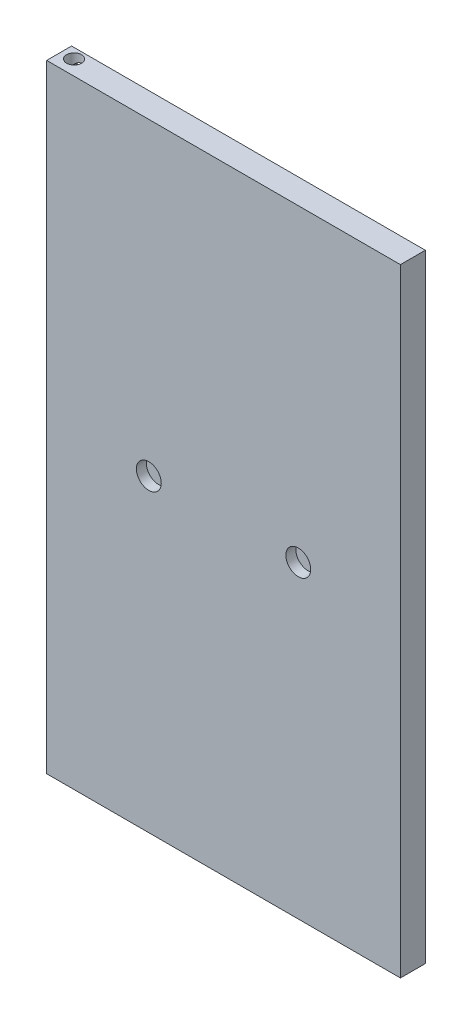
ISO-10303-21;
HEADER;
FILE_DESCRIPTION(('STEP AP214'),'2;1');
FILE_NAME('part.step','',(''),(''),'','','');
FILE_SCHEMA(('AUTOMOTIVE_DESIGN { 1 0 10303 214 1 1 1 1 }'));
ENDSEC;
DATA;
#1=APPLICATION_CONTEXT('core data for automotive mechanical design processes');
#2=APPLICATION_PROTOCOL_DEFINITION('international standard','automotive_design',2000,#1);
#3=PRODUCT_CONTEXT('',#1,'mechanical');
#4=PRODUCT('Part','Part','',(#3));
#5=PRODUCT_RELATED_PRODUCT_CATEGORY('part','',(#4));
#6=PRODUCT_DEFINITION_FORMATION('','',#4);
#7=PRODUCT_DEFINITION_CONTEXT('part definition',#1,'design');
#8=PRODUCT_DEFINITION('design','',#6,#7);
#9=PRODUCT_DEFINITION_SHAPE('','',#8);
#10=(LENGTH_UNIT() NAMED_UNIT(*) SI_UNIT(.MILLI.,.METRE.));
#11=(NAMED_UNIT(*) PLANE_ANGLE_UNIT() SI_UNIT($,.RADIAN.));
#12=(NAMED_UNIT(*) SI_UNIT($,.STERADIAN.) SOLID_ANGLE_UNIT());
#13=UNCERTAINTY_MEASURE_WITH_UNIT(LENGTH_MEASURE(1.E-05),#10,'distance_accuracy_value','');
#14=(GEOMETRIC_REPRESENTATION_CONTEXT(3) GLOBAL_UNCERTAINTY_ASSIGNED_CONTEXT((#13)) GLOBAL_UNIT_ASSIGNED_CONTEXT((#10,
#11,#12)) REPRESENTATION_CONTEXT('',''));
#15=CARTESIAN_POINT('',(0.,0.,0.));
#16=DIRECTION('',(0.,0.,1.));
#17=DIRECTION('',(1.,0.,0.));
#18=AXIS2_PLACEMENT_3D('',#15,#16,#17);
#19=CARTESIAN_POINT('',(-83.82,-149.86,-7.62));
#20=DIRECTION('',(0.,0.,1.));
#21=DIRECTION('',(1.,0.,0.));
#22=AXIS2_PLACEMENT_3D('',#19,#20,#21);
#23=PLANE('',#22);
#24=DIRECTION('',(1.,0.,0.));
#25=VECTOR('',#24,1.);
#26=CARTESIAN_POINT('',(-83.82,-149.86,-7.62));
#27=LINE('',#26,#25);
#28=CARTESIAN_POINT('',(-87.63,-149.86,-7.62));
#29=VERTEX_POINT('',#28);
#30=CARTESIAN_POINT('',(-80.0099999999999,-149.86,-7.62));
#31=VERTEX_POINT('',#30);
#32=EDGE_CURVE('E11',#29,#31,#27,.T.);
#33=ORIENTED_EDGE('',*,*,#32,.F.);
#34=CARTESIAN_POINT('',(-83.82,-149.86,-7.62));
#35=DIRECTION('',(0.,0.,-1.));
#36=DIRECTION('',(1.,0.,0.));
#37=AXIS2_PLACEMENT_3D('',#34,#35,#36);
#38=CIRCLE('',#37,3.81);
#39=EDGE_CURVE('E101',#29,#31,#38,.T.);
#40=ORIENTED_EDGE('',*,*,#39,.T.);
#41=EDGE_LOOP('',(#33,#40));
#42=FACE_BOUND('',#41,.T.);
#43=ADVANCED_FACE('F32',(#42),#23,.F.);
#44=CARTESIAN_POINT('',(90.17,157.48,-12.7));
#45=DIRECTION('',(1.,0.,0.));
#46=DIRECTION('',(0.,1.,0.));
#47=AXIS2_PLACEMENT_3D('',#44,#45,#46);
#48=PLANE('',#47);
#49=DIRECTION('',(0.,1.,0.));
#50=VECTOR('',#49,1.);
#51=CARTESIAN_POINT('',(90.17,157.48,0.));
#52=LINE('',#51,#50);
#53=CARTESIAN_POINT('',(90.17,-157.48,0.));
#54=VERTEX_POINT('',#53);
#55=CARTESIAN_POINT('',(90.17,157.48,0.));
#56=VERTEX_POINT('',#55);
#57=EDGE_CURVE('E131',#54,#56,#52,.T.);
#58=ORIENTED_EDGE('',*,*,#57,.F.);
#59=DIRECTION('',(0.,0.,1.));
#60=VECTOR('',#59,1.);
#61=CARTESIAN_POINT('',(90.17,-157.48,-12.7));
#62=LINE('',#61,#60);
#63=CARTESIAN_POINT('',(90.17,-157.48,-12.7));
#64=VERTEX_POINT('',#63);
#65=EDGE_CURVE('E161',#64,#54,#62,.T.);
#66=ORIENTED_EDGE('',*,*,#65,.F.);
#67=DIRECTION('',(0.,1.,0.));
#68=VECTOR('',#67,1.);
#69=CARTESIAN_POINT('',(90.17,157.48,-12.7));
#70=LINE('',#69,#68);
#71=CARTESIAN_POINT('',(90.17,157.48,-12.7));
#72=VERTEX_POINT('',#71);
#73=EDGE_CURVE('E137',#64,#72,#70,.T.);
#74=ORIENTED_EDGE('',*,*,#73,.T.);
#75=DIRECTION('',(0.,0.,1.));
#76=VECTOR('',#75,1.);
#77=CARTESIAN_POINT('',(90.17,157.48,-12.7));
#78=LINE('',#77,#76);
#79=EDGE_CURVE('E150',#72,#56,#78,.T.);
#80=ORIENTED_EDGE('',*,*,#79,.T.);
#81=EDGE_LOOP('',(#58,#66,#74,#80));
#82=FACE_BOUND('',#81,.T.);
#83=ADVANCED_FACE('F34',(#82),#48,.T.);
#84=CARTESIAN_POINT('',(-90.1699999999999,-157.48,-12.7));
#85=DIRECTION('',(0.,-1.,0.));
#86=DIRECTION('',(0.,0.,-1.));
#87=AXIS2_PLACEMENT_3D('',#84,#85,#86);
#88=PLANE('',#87);
#89=CARTESIAN_POINT('',(-83.8199999999999,-157.48,-7.62));
#90=DIRECTION('',(0.,-1.,0.));
#91=DIRECTION('',(0.,0.,-1.));
#92=AXIS2_PLACEMENT_3D('',#89,#90,#91);
#93=CIRCLE('',#92,3.81);
#94=CARTESIAN_POINT('',(-83.8199999999999,-157.48,-11.43));
#95=VERTEX_POINT('',#94);
#96=EDGE_CURVE('E96',#95,#95,#93,.T.);
#97=ORIENTED_EDGE('',*,*,#96,.F.);
#98=EDGE_LOOP('',(#97));
#99=FACE_BOUND('',#98,.T.);
#100=DIRECTION('',(1.,0.,0.));
#101=VECTOR('',#100,1.);
#102=CARTESIAN_POINT('',(-90.1699999999999,-157.48,0.));
#103=LINE('',#102,#101);
#104=CARTESIAN_POINT('',(-90.1699999999999,-157.48,0.));
#105=VERTEX_POINT('',#104);
#106=EDGE_CURVE('E141',#105,#54,#103,.T.);
#107=ORIENTED_EDGE('',*,*,#106,.F.);
#108=DIRECTION('',(0.,0.,1.));
#109=VECTOR('',#108,1.);
#110=CARTESIAN_POINT('',(-90.1699999999999,-157.48,-12.7));
#111=LINE('',#110,#109);
#112=CARTESIAN_POINT('',(-90.1699999999999,-157.48,-12.7));
#113=VERTEX_POINT('',#112);
#114=EDGE_CURVE('E164',#113,#105,#111,.T.);
#115=ORIENTED_EDGE('',*,*,#114,.F.);
#116=DIRECTION('',(1.,0.,0.));
#117=VECTOR('',#116,1.);
#118=CARTESIAN_POINT('',(-90.1699999999999,-157.48,-12.7));
#119=LINE('',#118,#117);
#120=EDGE_CURVE('E147',#113,#64,#119,.T.);
#121=ORIENTED_EDGE('',*,*,#120,.T.);
#122=ORIENTED_EDGE('',*,*,#65,.T.);
#123=EDGE_LOOP('',(#107,#115,#121,#122));
#124=FACE_BOUND('',#123,.T.);
#125=ADVANCED_FACE('F191',(#99,#124),#88,.T.);
#126=CARTESIAN_POINT('',(-90.17,157.48,-12.7));
#127=DIRECTION('',(-1.,0.,0.));
#128=DIRECTION('',(0.,-1.,0.));
#129=AXIS2_PLACEMENT_3D('',#126,#127,#128);
#130=PLANE('',#129);
#131=DIRECTION('',(0.,-1.,0.));
#132=VECTOR('',#131,1.);
#133=CARTESIAN_POINT('',(-90.17,157.48,0.));
#134=LINE('',#133,#132);
#135=CARTESIAN_POINT('',(-90.17,157.48,0.));
#136=VERTEX_POINT('',#135);
#137=EDGE_CURVE('E156',#136,#105,#134,.T.);
#138=ORIENTED_EDGE('',*,*,#137,.F.);
#139=DIRECTION('',(0.,0.,1.));
#140=VECTOR('',#139,1.);
#141=CARTESIAN_POINT('',(-90.17,157.48,-12.7));
#142=LINE('',#141,#140);
#143=CARTESIAN_POINT('',(-90.17,157.48,-12.7));
#144=VERTEX_POINT('',#143);
#145=EDGE_CURVE('E166',#144,#136,#142,.T.);
#146=ORIENTED_EDGE('',*,*,#145,.F.);
#147=DIRECTION('',(0.,-1.,0.));
#148=VECTOR('',#147,1.);
#149=CARTESIAN_POINT('',(-90.17,157.48,-12.7));
#150=LINE('',#149,#148);
#151=EDGE_CURVE('E144',#144,#113,#150,.T.);
#152=ORIENTED_EDGE('',*,*,#151,.T.);
#153=ORIENTED_EDGE('',*,*,#114,.T.);
#154=EDGE_LOOP('',(#138,#146,#152,#153));
#155=FACE_BOUND('',#154,.T.);
#156=ADVANCED_FACE('F194',(#155),#130,.T.);
#157=CARTESIAN_POINT('',(-90.17,157.48,-12.7));
#158=DIRECTION('',(0.,1.,0.));
#159=DIRECTION('',(0.,0.,1.));
#160=AXIS2_PLACEMENT_3D('',#157,#158,#159);
#161=PLANE('',#160);
#162=CARTESIAN_POINT('',(-83.82,157.48,-7.62));
#163=DIRECTION('',(0.,1.,0.));
#164=DIRECTION('',(0.,0.,1.));
#165=AXIS2_PLACEMENT_3D('',#162,#163,#164);
#166=CIRCLE('',#165,3.81);
#167=CARTESIAN_POINT('',(-83.82,157.48,-3.81));
#168=VERTEX_POINT('',#167);
#169=EDGE_CURVE('E102',#168,#168,#166,.T.);
#170=ORIENTED_EDGE('',*,*,#169,.F.);
#171=EDGE_LOOP('',(#170));
#172=FACE_BOUND('',#171,.T.);
#173=DIRECTION('',(-1.,0.,0.));
#174=VECTOR('',#173,1.);
#175=CARTESIAN_POINT('',(-90.17,157.48,0.));
#176=LINE('',#175,#174);
#177=EDGE_CURVE('E153',#56,#136,#176,.T.);
#178=ORIENTED_EDGE('',*,*,#177,.F.);
#179=ORIENTED_EDGE('',*,*,#79,.F.);
#180=DIRECTION('',(-1.,0.,0.));
#181=VECTOR('',#180,1.);
#182=CARTESIAN_POINT('',(-90.17,157.48,-12.7));
#183=LINE('',#182,#181);
#184=EDGE_CURVE('E140',#72,#144,#183,.T.);
#185=ORIENTED_EDGE('',*,*,#184,.T.);
#186=ORIENTED_EDGE('',*,*,#145,.T.);
#187=EDGE_LOOP('',(#178,#179,#185,#186));
#188=FACE_BOUND('',#187,.T.);
#189=ADVANCED_FACE('F211',(#172,#188),#161,.T.);
#190=CARTESIAN_POINT('',(0.,0.,-12.7));
#191=DIRECTION('',(0.,0.,1.));
#192=DIRECTION('',(1.,0.,0.));
#193=AXIS2_PLACEMENT_3D('',#190,#191,#192);
#194=PLANE('',#193);
#195=CARTESIAN_POINT('',(-83.82,-149.86,-12.7));
#196=DIRECTION('',(0.,0.,-1.));
#197=DIRECTION('',(1.,0.,0.));
#198=AXIS2_PLACEMENT_3D('',#195,#196,#197);
#199=CIRCLE('',#198,3.81);
#200=CARTESIAN_POINT('',(-80.01,-149.86,-12.7));
#201=VERTEX_POINT('',#200);
#202=EDGE_CURVE('E105',#201,#201,#199,.T.);
#203=ORIENTED_EDGE('',*,*,#202,.F.);
#204=EDGE_LOOP('',(#203));
#205=FACE_BOUND('',#204,.T.);
#206=CARTESIAN_POINT('',(-83.7598726321291,149.86,-12.7));
#207=DIRECTION('',(0.,0.,-1.));
#208=DIRECTION('',(-1.,0.,0.));
#209=AXIS2_PLACEMENT_3D('',#206,#207,#208);
#210=CIRCLE('',#209,3.81);
#211=CARTESIAN_POINT('',(-87.5698726321291,149.86,-12.7));
#212=VERTEX_POINT('',#211);
#213=EDGE_CURVE('E125',#212,#212,#210,.T.);
#214=ORIENTED_EDGE('',*,*,#213,.F.);
#215=EDGE_LOOP('',(#214));
#216=FACE_BOUND('',#215,.T.);
#217=ORIENTED_EDGE('',*,*,#73,.F.);
#218=ORIENTED_EDGE('',*,*,#120,.F.);
#219=ORIENTED_EDGE('',*,*,#151,.F.);
#220=ORIENTED_EDGE('',*,*,#184,.F.);
#221=EDGE_LOOP('',(#217,#218,#219,#220));
#222=FACE_BOUND('',#221,.T.);
#223=ADVANCED_FACE('F208',(#205,#216,#222),#194,.F.);
#224=CARTESIAN_POINT('',(0.,0.,0.));
#225=DIRECTION('',(0.,0.,1.));
#226=DIRECTION('',(1.,0.,0.));
#227=AXIS2_PLACEMENT_3D('',#224,#225,#226);
#228=PLANE('',#227);
#229=CARTESIAN_POINT('',(-38.1,0.,0.));
#230=DIRECTION('',(0.,0.,1.));
#231=DIRECTION('',(1.,0.,0.));
#232=AXIS2_PLACEMENT_3D('',#229,#230,#231);
#233=CIRCLE('',#232,6.35);
#234=CARTESIAN_POINT('',(-31.75,0.,0.));
#235=VERTEX_POINT('',#234);
#236=EDGE_CURVE('E132',#235,#235,#233,.T.);
#237=ORIENTED_EDGE('',*,*,#236,.F.);
#238=EDGE_LOOP('',(#237));
#239=FACE_BOUND('',#238,.T.);
#240=CARTESIAN_POINT('',(38.1,0.,0.));
#241=DIRECTION('',(0.,0.,1.));
#242=DIRECTION('',(1.,0.,0.));
#243=AXIS2_PLACEMENT_3D('',#240,#241,#242);
#244=CIRCLE('',#243,6.35);
#245=CARTESIAN_POINT('',(44.45,0.,0.));
#246=VERTEX_POINT('',#245);
#247=EDGE_CURVE('E104',#246,#246,#244,.T.);
#248=ORIENTED_EDGE('',*,*,#247,.F.);
#249=EDGE_LOOP('',(#248));
#250=FACE_BOUND('',#249,.T.);
#251=ORIENTED_EDGE('',*,*,#57,.T.);
#252=ORIENTED_EDGE('',*,*,#177,.T.);
#253=ORIENTED_EDGE('',*,*,#137,.T.);
#254=ORIENTED_EDGE('',*,*,#106,.T.);
#255=EDGE_LOOP('',(#251,#252,#253,#254));
#256=FACE_BOUND('',#255,.T.);
#257=ADVANCED_FACE('F199',(#239,#250,#256),#228,.T.);
#258=CARTESIAN_POINT('',(38.1,0.,-5.08));
#259=DIRECTION('',(0.,0.,1.));
#260=DIRECTION('',(1.,0.,0.));
#261=AXIS2_PLACEMENT_3D('',#258,#259,#260);
#262=CYLINDRICAL_SURFACE('',#261,6.35);
#263=CARTESIAN_POINT('',(38.1,0.,-5.08));
#264=DIRECTION('',(0.,0.,1.));
#265=DIRECTION('',(1.,0.,0.));
#266=AXIS2_PLACEMENT_3D('',#263,#264,#265);
#267=CIRCLE('',#266,6.35);
#268=CARTESIAN_POINT('',(44.45,0.,-5.08));
#269=VERTEX_POINT('',#268);
#270=EDGE_CURVE('E108',#269,#269,#267,.T.);
#271=ORIENTED_EDGE('',*,*,#270,.F.);
#272=EDGE_LOOP('',(#271));
#273=FACE_BOUND('',#272,.T.);
#274=ORIENTED_EDGE('',*,*,#247,.T.);
#275=EDGE_LOOP('',(#274));
#276=FACE_BOUND('',#275,.T.);
#277=ADVANCED_FACE('F248',(#273,#276),#262,.F.);
#278=CARTESIAN_POINT('',(38.1,0.,-5.08));
#279=DIRECTION('',(0.,0.,1.));
#280=DIRECTION('',(1.,0.,0.));
#281=AXIS2_PLACEMENT_3D('',#278,#279,#280);
#282=PLANE('',#281);
#283=ORIENTED_EDGE('',*,*,#270,.T.);
#284=EDGE_LOOP('',(#283));
#285=FACE_BOUND('',#284,.T.);
#286=ADVANCED_FACE('F244',(#285),#282,.T.);
#287=CARTESIAN_POINT('',(-38.1,0.,-5.08));
#288=DIRECTION('',(0.,0.,1.));
#289=DIRECTION('',(1.,0.,0.));
#290=AXIS2_PLACEMENT_3D('',#287,#288,#289);
#291=CYLINDRICAL_SURFACE('',#290,6.35);
#292=CARTESIAN_POINT('',(-38.1,0.,-5.08));
#293=DIRECTION('',(0.,0.,1.));
#294=DIRECTION('',(1.,0.,0.));
#295=AXIS2_PLACEMENT_3D('',#292,#293,#294);
#296=CIRCLE('',#295,6.35);
#297=CARTESIAN_POINT('',(-31.75,0.,-5.08));
#298=VERTEX_POINT('',#297);
#299=EDGE_CURVE('E128',#298,#298,#296,.T.);
#300=ORIENTED_EDGE('',*,*,#299,.F.);
#301=EDGE_LOOP('',(#300));
#302=FACE_BOUND('',#301,.T.);
#303=ORIENTED_EDGE('',*,*,#236,.T.);
#304=EDGE_LOOP('',(#303));
#305=FACE_BOUND('',#304,.T.);
#306=ADVANCED_FACE('F240',(#302,#305),#291,.F.);
#307=CARTESIAN_POINT('',(-38.1,0.,-5.08));
#308=DIRECTION('',(0.,0.,1.));
#309=DIRECTION('',(1.,0.,0.));
#310=AXIS2_PLACEMENT_3D('',#307,#308,#309);
#311=PLANE('',#310);
#312=ORIENTED_EDGE('',*,*,#299,.T.);
#313=EDGE_LOOP('',(#312));
#314=FACE_BOUND('',#313,.T.);
#315=ADVANCED_FACE('F238',(#314),#311,.T.);
#316=CARTESIAN_POINT('',(-83.7598726321291,149.86,-7.62));
#317=DIRECTION('',(0.,0.,-1.));
#318=DIRECTION('',(-1.,0.,0.));
#319=AXIS2_PLACEMENT_3D('',#316,#317,#318);
#320=CYLINDRICAL_SURFACE('',#319,3.81);
#321=CARTESIAN_POINT('',(-83.7598726321291,149.86,-7.62));
#322=DIRECTION('',(0.,0.,-1.));
#323=DIRECTION('',(-1.,0.,0.));
#324=AXIS2_PLACEMENT_3D('',#321,#322,#323);
#325=CIRCLE('',#324,3.81);
#326=CARTESIAN_POINT('',(-80.01,150.534207121595,-7.62));
#327=VERTEX_POINT('',#326);
#328=CARTESIAN_POINT('',(-87.5698726321291,149.86,-7.62));
#329=VERTEX_POINT('',#328);
#330=EDGE_CURVE('E111',#327,#329,#325,.T.);
#331=ORIENTED_EDGE('',*,*,#330,.F.);
#332=CARTESIAN_POINT('',(-80.01,150.534207121595,-7.62));
#333=CARTESIAN_POINT('',(-80.0099762434054,150.53394318835,-7.67261982825665));
#334=CARTESIAN_POINT('',(-80.0110882006961,150.540305308723,-7.72457038053818));
#335=CARTESIAN_POINT('',(-80.0152036193817,150.56264586858,-7.82502932399688));
#336=CARTESIAN_POINT('',(-80.0181593884532,150.57838140466,-7.87359117303249));
#337=CARTESIAN_POINT('',(-80.0259460989729,150.617833156805,-7.97205766550278));
#338=CARTESIAN_POINT('',(-80.0309204465937,150.642134737581,-8.02169754613748));
#339=CARTESIAN_POINT('',(-80.0424299312676,150.695147939484,-8.118421022151));
#340=CARTESIAN_POINT('',(-80.0489680866256,150.723868050089,-8.1654994552912));
#341=CARTESIAN_POINT('',(-80.0710033538233,150.81512139764,-8.3057567237118));
#342=CARTESIAN_POINT('',(-80.0887398518635,150.881721657212,-8.39589008434912));
#343=CARTESIAN_POINT('',(-80.1248653269547,151.002754619961,-8.55101929075257));
#344=CARTESIAN_POINT('',(-80.1421268836521,151.056380206303,-8.61695518522432));
#345=CARTESIAN_POINT('',(-80.1798312647163,151.164871611062,-8.7468770752166));
#346=CARTESIAN_POINT('',(-80.2002740121835,151.219737399472,-8.81086311782664));
#347=CARTESIAN_POINT('',(-80.2664451715412,151.385180304174,-9.00070705183377));
#348=CARTESIAN_POINT('',(-80.3169793877849,151.496474533242,-9.12429362169302));
#349=CARTESIAN_POINT('',(-80.4307078203133,151.716894899845,-9.36538732654818));
#350=CARTESIAN_POINT('',(-80.493793287615,151.826031369962,-9.4829364635457));
#351=CARTESIAN_POINT('',(-80.6333563035641,152.041150875156,-9.71271513431734));
#352=CARTESIAN_POINT('',(-80.7098226818113,152.147136454934,-9.82494900675379));
#353=CARTESIAN_POINT('',(-80.853100317144,152.324925422605,-10.0123396454591));
#354=CARTESIAN_POINT('',(-80.916505276202,152.397902892105,-10.0889890554259));
#355=CARTESIAN_POINT('',(-81.0507114709836,152.540701046829,-10.2386361440395));
#356=CARTESIAN_POINT('',(-81.1215131988258,152.610521521572,-10.3116335792363));
#357=CARTESIAN_POINT('',(-81.3453835167978,152.814145892659,-10.5242517505971));
#358=CARTESIAN_POINT('',(-81.5100369155955,152.942265410909,-10.6576585234461));
#359=CARTESIAN_POINT('',(-81.8278891942222,153.14792573494,-10.8719502049072));
#360=CARTESIAN_POINT('',(-81.9746372106267,153.230269815404,-10.9578026296246));
#361=CARTESIAN_POINT('',(-82.2854115102056,153.377311673895,-11.1115699389631));
#362=CARTESIAN_POINT('',(-82.4494126889402,153.442034612611,-11.1795103951009));
#363=CARTESIAN_POINT('',(-82.7653677112504,153.541043371371,-11.2843032190949));
#364=CARTESIAN_POINT('',(-82.9152672419699,153.578487010434,-11.3243371700373));
#365=CARTESIAN_POINT('',(-83.2221659172008,153.635084454788,-11.3860505673413));
#366=CARTESIAN_POINT('',(-83.3791610584118,153.654248441697,-11.4077402305604));
#367=CARTESIAN_POINT('',(-83.6962705753481,153.672786825251,-11.4313164686224));
#368=CARTESIAN_POINT('',(-83.85639251268,153.672105139396,-11.4331469026439));
#369=CARTESIAN_POINT('',(-84.1742566742276,153.650748087237,-11.4168329407914));
#370=CARTESIAN_POINT('',(-84.3319985566575,153.630069876587,-11.3986857032015));
#371=CARTESIAN_POINT('',(-84.6340834237658,153.571410584139,-11.3450431109917));
#372=CARTESIAN_POINT('',(-84.7787107803417,153.534182489689,-11.3102982684751));
#373=CARTESIAN_POINT('',(-85.0586700934456,153.444809534887,-11.2259964985733));
#374=CARTESIAN_POINT('',(-85.1939982650933,153.392658644852,-11.1764335834573));
#375=CARTESIAN_POINT('',(-85.5053299445888,153.252501733449,-11.0426820029262));
#376=CARTESIAN_POINT('',(-85.6760880550693,153.158486081795,-10.9525630843187));
#377=CARTESIAN_POINT('',(-85.9942807497247,152.951875790018,-10.7543162212385));
#378=CARTESIAN_POINT('',(-86.1416674728771,152.839243965509,-10.6461522289736));
#379=CARTESIAN_POINT('',(-86.4640303906056,152.555441557462,-10.3740395081392));
#380=CARTESIAN_POINT('',(-86.6287632141859,152.37811518925,-10.204340439745));
#381=CARTESIAN_POINT('',(-86.8449232920092,152.098853415082,-9.93926762079519));
#382=CARTESIAN_POINT('',(-86.9118894970472,152.003416341967,-9.84902707616068));
#383=CARTESIAN_POINT('',(-87.0359091945928,151.808591618882,-9.66602563673983));
#384=CARTESIAN_POINT('',(-87.0929660189009,151.709205310617,-9.57326560125181));
#385=CARTESIAN_POINT('',(-87.1879735542659,151.525205064525,-9.40340382364553));
#386=CARTESIAN_POINT('',(-87.2275116998896,151.441193696592,-9.32652406821252));
#387=CARTESIAN_POINT('',(-87.3003498273467,151.270579431749,-9.17258065109499));
#388=CARTESIAN_POINT('',(-87.3336469226846,151.183975357077,-9.09551692092685));
#389=CARTESIAN_POINT('',(-87.3940011380455,151.00797474679,-8.94263335725998));
#390=CARTESIAN_POINT('',(-87.4210736669731,150.918585742671,-8.86681089325492));
#391=CARTESIAN_POINT('',(-87.4690834382361,150.73569168748,-8.71831642505392));
#392=CARTESIAN_POINT('',(-87.4900282501543,150.64219188022,-8.64564062918619));
#393=CARTESIAN_POINT('',(-87.5178676760685,150.489844196759,-8.53842794812518));
#394=CARTESIAN_POINT('',(-87.52692398023,150.433466761954,-8.5009731683382));
#395=CARTESIAN_POINT('',(-87.542799527108,150.31717794906,-8.43124686403497));
#396=CARTESIAN_POINT('',(-87.5496206216839,150.257269545165,-8.39897106013763));
#397=CARTESIAN_POINT('',(-87.5588581211218,150.152604036961,-8.3530798835313));
#398=CARTESIAN_POINT('',(-87.561985520924,150.109119384296,-8.33679704093686));
#399=CARTESIAN_POINT('',(-87.5667636859937,150.020098543492,-8.31140577767007));
#400=CARTESIAN_POINT('',(-87.5684218010437,149.974573777251,-8.3022616746559));
#401=CARTESIAN_POINT('',(-87.5696677932574,149.905823472071,-8.29534030626462));
#402=CARTESIAN_POINT('',(-87.5698778653994,149.882922126735,-8.29415699569181));
#403=CARTESIAN_POINT('',(-87.5698726321291,149.86,-8.29420712159473));
#404=B_SPLINE_CURVE_WITH_KNOTS('',3,(#332,#333,#334,#335,#336,#337,#338,#339,#340,#341,#342,
#343,#344,#345,#346,#347,#348,#349,#350,#351,#352,#353,#354,#355,#356,#357,#358,#359,#360,#361,
#362,#363,#364,#365,#366,#367,#368,#369,#370,#371,#372,#373,#374,#375,#376,#377,#378,#379,#380,
#381,#382,#383,#384,#385,#386,#387,#388,#389,#390,#391,#392,#393,#394,#395,#396,#397,#398,#399,
#400,#401,#402,#403),.UNSPECIFIED.,.F.,.F.,(4,2,2,2,2,2,2,2,2,2,2,2,2,2,2,2,2,2,2,2,2,2,2,2,2,2,
2,2,2,2,2,2,2,2,2,4),(0.,0.156435889164792,0.308984202825278,0.47510122973662,0.641541503795143,
0.981303758397573,1.24142663179761,1.50154321816502,2.02239330104504,2.53891300984308,
3.05500356667376,3.42481691148428,3.79465487624166,4.53358308669611,5.09830730361823,
5.66222088795956,6.13899702212777,6.61550744046843,7.09336457468263,7.57128969028055,
8.02939837494067,8.48769242429078,9.12837149174654,9.77034608458909,10.6519990269465,
11.0940199743566,11.5358920134912,11.8973625601499,12.2589998771893,12.6197320843244,
12.9800167781865,13.1847306176446,13.3892744214206,13.5284857006203,13.6669966086775,
13.7357039784698),.UNSPECIFIED.);
#405=CARTESIAN_POINT('',(-87.5698726321291,149.86,-8.29420712159474));
#406=VERTEX_POINT('',#405);
#407=EDGE_CURVE('E114',#327,#406,#404,.T.);
#408=ORIENTED_EDGE('',*,*,#407,.T.);
#409=DIRECTION('',(0.,0.,-1.));
#410=VECTOR('',#409,1.);
#411=CARTESIAN_POINT('',(-87.5698726321291,149.86,-7.62));
#412=LINE('',#411,#410);
#413=EDGE_CURVE('E179',#329,#406,#412,.T.);
#414=ORIENTED_EDGE('',*,*,#413,.F.);
#415=EDGE_LOOP('',(#331,#408,#414));
#416=FACE_BOUND('',#415,.T.);
#417=ORIENTED_EDGE('',*,*,#213,.T.);
#418=EDGE_LOOP('',(#417));
#419=FACE_BOUND('',#418,.T.);
#420=ADVANCED_FACE('F181',(#416,#419),#320,.F.);
#421=CARTESIAN_POINT('',(-83.7598726321291,149.86,-7.62));
#422=DIRECTION('',(0.,0.,-1.));
#423=DIRECTION('',(-1.,0.,0.));
#424=AXIS2_PLACEMENT_3D('',#421,#422,#423);
#425=PLANE('',#424);
#426=DIRECTION('',(0.,1.,0.));
#427=VECTOR('',#426,1.);
#428=CARTESIAN_POINT('',(-80.01,149.86,-7.62));
#429=LINE('',#428,#427);
#430=CARTESIAN_POINT('',(-80.01,149.86,-7.62));
#431=VERTEX_POINT('',#430);
#432=EDGE_CURVE('E40',#327,#431,#429,.F.);
#433=ORIENTED_EDGE('',*,*,#432,.F.);
#434=ORIENTED_EDGE('',*,*,#330,.T.);
#435=DIRECTION('',(1.,0.,0.));
#436=VECTOR('',#435,1.);
#437=CARTESIAN_POINT('',(-83.7598726321291,149.86,-7.62));
#438=LINE('',#437,#436);
#439=EDGE_CURVE('E163',#329,#431,#438,.T.);
#440=ORIENTED_EDGE('',*,*,#439,.T.);
#441=EDGE_LOOP('',(#433,#434,#440));
#442=FACE_BOUND('',#441,.T.);
#443=ADVANCED_FACE('F176',(#442),#425,.T.);
#444=CARTESIAN_POINT('',(-83.82,-149.86,-7.62));
#445=DIRECTION('',(0.,0.,-1.));
#446=DIRECTION('',(-1.,0.,0.));
#447=AXIS2_PLACEMENT_3D('',#444,#445,#446);
#448=CYLINDRICAL_SURFACE('',#447,3.81);
#449=ORIENTED_EDGE('',*,*,#39,.F.);
#450=CARTESIAN_POINT('',(-83.82,-149.86,-7.62));
#451=DIRECTION('',(0.,0.707106781186547,-0.707106781186548));
#452=DIRECTION('',(0.,-0.707106781186547,-0.707106781186548));
#453=AXIS2_PLACEMENT_3D('',#450,#451,#452);
#454=ELLIPSE('',#453,5.38815367264149,3.81);
#455=EDGE_CURVE('E95',#29,#31,#454,.F.);
#456=ORIENTED_EDGE('',*,*,#455,.T.);
#457=EDGE_LOOP('',(#449,#456));
#458=FACE_BOUND('',#457,.T.);
#459=ORIENTED_EDGE('',*,*,#202,.T.);
#460=EDGE_LOOP('',(#459));
#461=FACE_BOUND('',#460,.T.);
#462=ADVANCED_FACE('F99',(#458,#461),#448,.F.);
#463=CARTESIAN_POINT('',(-83.82,149.86,-7.62));
#464=DIRECTION('',(0.,1.,0.));
#465=DIRECTION('',(0.,0.,1.));
#466=AXIS2_PLACEMENT_3D('',#463,#464,#465);
#467=CYLINDRICAL_SURFACE('',#466,3.81);
#468=ORIENTED_EDGE('',*,*,#169,.T.);
#469=EDGE_LOOP('',(#468));
#470=FACE_BOUND('',#469,.T.);
#471=ORIENTED_EDGE('',*,*,#432,.T.);
#472=CARTESIAN_POINT('',(-83.82,149.86,-7.62));
#473=DIRECTION('',(0.,1.,0.));
#474=DIRECTION('',(0.,0.,1.));
#475=AXIS2_PLACEMENT_3D('',#472,#473,#474);
#476=CIRCLE('',#475,3.81);
#477=EDGE_CURVE('E53',#406,#431,#476,.T.);
#478=ORIENTED_EDGE('',*,*,#477,.F.);
#479=ORIENTED_EDGE('',*,*,#407,.F.);
#480=EDGE_LOOP('',(#471,#478,#479));
#481=FACE_BOUND('',#480,.T.);
#482=ADVANCED_FACE('F172',(#470,#481),#467,.F.);
#483=CARTESIAN_POINT('',(-83.82,149.86,-7.62));
#484=DIRECTION('',(0.,1.,0.));
#485=DIRECTION('',(0.,0.,1.));
#486=AXIS2_PLACEMENT_3D('',#483,#484,#485);
#487=PLANE('',#486);
#488=ORIENTED_EDGE('',*,*,#413,.T.);
#489=ORIENTED_EDGE('',*,*,#477,.T.);
#490=ORIENTED_EDGE('',*,*,#439,.F.);
#491=EDGE_LOOP('',(#488,#489,#490));
#492=FACE_BOUND('',#491,.T.);
#493=ADVANCED_FACE('F178',(#492),#487,.T.);
#494=CARTESIAN_POINT('',(-83.8199999999999,-149.86,-7.62));
#495=DIRECTION('',(0.,-1.,0.));
#496=DIRECTION('',(0.,0.,-1.));
#497=AXIS2_PLACEMENT_3D('',#494,#495,#496);
#498=CYLINDRICAL_SURFACE('',#497,3.81);
#499=ORIENTED_EDGE('',*,*,#96,.T.);
#500=EDGE_LOOP('',(#499));
#501=FACE_BOUND('',#500,.T.);
#502=CARTESIAN_POINT('',(-83.8199999999999,-149.86,-7.62));
#503=DIRECTION('',(0.,-1.,0.));
#504=DIRECTION('',(0.,0.,-1.));
#505=AXIS2_PLACEMENT_3D('',#502,#503,#504);
#506=CIRCLE('',#505,3.81);
#507=EDGE_CURVE('E45',#31,#29,#506,.T.);
#508=ORIENTED_EDGE('',*,*,#507,.F.);
#509=ORIENTED_EDGE('',*,*,#455,.F.);
#510=EDGE_LOOP('',(#508,#509));
#511=FACE_BOUND('',#510,.T.);
#512=ADVANCED_FACE('F94',(#501,#511),#498,.F.);
#513=CARTESIAN_POINT('',(-83.8199999999999,-149.86,-7.62));
#514=DIRECTION('',(0.,-1.,0.));
#515=DIRECTION('',(0.,0.,-1.));
#516=AXIS2_PLACEMENT_3D('',#513,#514,#515);
#517=PLANE('',#516);
#518=ORIENTED_EDGE('',*,*,#32,.T.);
#519=ORIENTED_EDGE('',*,*,#507,.T.);
#520=EDGE_LOOP('',(#518,#519));
#521=FACE_BOUND('',#520,.T.);
#522=ADVANCED_FACE('F88',(#521),#517,.T.);
#523=CLOSED_SHELL('',(#43,#83,#125,#156,#189,#223,#257,#277,#286,#306,#315,#420,#443,#462,#482,
#493,#512,#522));
#524=MANIFOLD_SOLID_BREP('B2',#523);
#525=ADVANCED_BREP_SHAPE_REPRESENTATION('',(#18,#524),#14);
#526=SHAPE_DEFINITION_REPRESENTATION(#9,#525);
ENDSEC;
END-ISO-10303-21;
